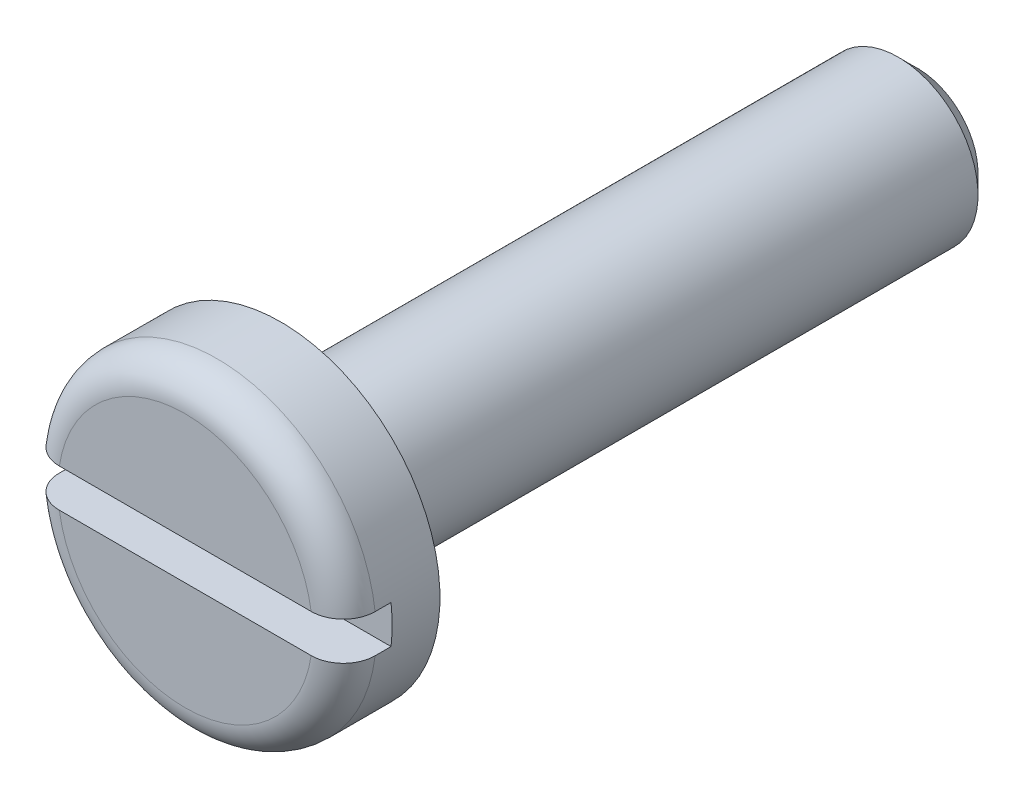
ISO-10303-21;
HEADER;
FILE_DESCRIPTION(('STEP AP214'),'2;1');
FILE_NAME('part.step','',(''),(''),'','','');
FILE_SCHEMA(('AUTOMOTIVE_DESIGN { 1 0 10303 214 1 1 1 1 }'));
ENDSEC;
DATA;
#1=APPLICATION_CONTEXT('core data for automotive mechanical design processes');
#2=APPLICATION_PROTOCOL_DEFINITION('international standard','automotive_design',2000,#1);
#3=PRODUCT_CONTEXT('',#1,'mechanical');
#4=PRODUCT('Part','Part','',(#3));
#5=PRODUCT_RELATED_PRODUCT_CATEGORY('part','',(#4));
#6=PRODUCT_DEFINITION_FORMATION('','',#4);
#7=PRODUCT_DEFINITION_CONTEXT('part definition',#1,'design');
#8=PRODUCT_DEFINITION('design','',#6,#7);
#9=PRODUCT_DEFINITION_SHAPE('','',#8);
#10=(LENGTH_UNIT() NAMED_UNIT(*) SI_UNIT(.MILLI.,.METRE.));
#11=(NAMED_UNIT(*) PLANE_ANGLE_UNIT() SI_UNIT($,.RADIAN.));
#12=(NAMED_UNIT(*) SI_UNIT($,.STERADIAN.) SOLID_ANGLE_UNIT());
#13=UNCERTAINTY_MEASURE_WITH_UNIT(LENGTH_MEASURE(1.E-05),#10,'distance_accuracy_value','');
#14=(GEOMETRIC_REPRESENTATION_CONTEXT(3) GLOBAL_UNCERTAINTY_ASSIGNED_CONTEXT((#13)) GLOBAL_UNIT_ASSIGNED_CONTEXT((#10,
#11,#12)) REPRESENTATION_CONTEXT('',''));
#15=CARTESIAN_POINT('',(0.,0.,0.));
#16=DIRECTION('',(0.,0.,1.));
#17=DIRECTION('',(1.,0.,0.));
#18=AXIS2_PLACEMENT_3D('',#15,#16,#17);
#19=CARTESIAN_POINT('',(0.,0.,0.));
#20=DIRECTION('',(0.,0.,0.999999999999908));
#21=DIRECTION('',(1.00000000000001,0.,0.));
#22=AXIS2_PLACEMENT_3D('',#19,#20,#21);
#23=PLANE('',#22);
#24=DIRECTION('',(1.00000000000001,0.,0.));
#25=VECTOR('',#24,1.);
#26=CARTESIAN_POINT('',(-5.00000000000057,-0.600000000000649,5.55111512312578E-13));
#27=LINE('',#26,#25);
#28=CARTESIAN_POINT('',(-3.95474398665757,-0.600000000000329,2.83106871279415E-12));
#29=VERTEX_POINT('',#28);
#30=CARTESIAN_POINT('',(3.95474398665656,-0.600000000000295,2.38697950294409E-12));
#31=VERTEX_POINT('',#30);
#32=EDGE_CURVE('E138',#29,#31,#27,.T.);
#33=ORIENTED_EDGE('',*,*,#32,.F.);
#34=CARTESIAN_POINT('',(0.,0.,0.));
#35=DIRECTION('',(0.,0.,0.999999999999908));
#36=DIRECTION('',(1.00000000000001,0.,0.));
#37=AXIS2_PLACEMENT_3D('',#34,#35,#36);
#38=CIRCLE('',#37,4.);
#39=EDGE_CURVE('E154',#29,#31,#38,.T.);
#40=ORIENTED_EDGE('',*,*,#39,.T.);
#41=EDGE_LOOP('',(#33,#40));
#42=FACE_BOUND('',#41,.T.);
#43=ADVANCED_FACE('F48',(#42),#23,.T.);
#44=DIRECTION('',(1.00000000000001,0.,0.));
#45=VECTOR('',#44,1.);
#46=CARTESIAN_POINT('',(-5.00000000000068,0.59999999999992,9.71445146547012E-13));
#47=LINE('',#46,#45);
#48=CARTESIAN_POINT('',(-3.95474398665734,0.599999999998886,6.66133814775094E-13));
#49=VERTEX_POINT('',#48);
#50=CARTESIAN_POINT('',(3.95474398665666,0.599999999999129,9.43689570931383E-13));
#51=VERTEX_POINT('',#50);
#52=EDGE_CURVE('E120',#49,#51,#47,.T.);
#53=ORIENTED_EDGE('',*,*,#52,.T.);
#54=CARTESIAN_POINT('',(0.,0.,0.));
#55=DIRECTION('',(0.,0.,0.999999999999908));
#56=DIRECTION('',(1.00000000000001,0.,0.));
#57=AXIS2_PLACEMENT_3D('',#54,#55,#56);
#58=CIRCLE('',#57,4.);
#59=EDGE_CURVE('E69',#51,#49,#58,.T.);
#60=ORIENTED_EDGE('',*,*,#59,.T.);
#61=EDGE_LOOP('',(#53,#60));
#62=FACE_BOUND('',#61,.T.);
#63=ADVANCED_FACE('F202',(#62),#23,.T.);
#64=CARTESIAN_POINT('',(-6.24500451351651E-13,-2.91433543964104E-13,-23.));
#65=DIRECTION('',(0.,0.,-0.999999999999908));
#66=DIRECTION('',(-1.00000000000001,0.,0.));
#67=AXIS2_PLACEMENT_3D('',#64,#65,#66);
#68=CYLINDRICAL_SURFACE('',#67,5.);
#69=DIRECTION('',(0.,0.,-0.999999999999908));
#70=VECTOR('',#69,1.);
#71=CARTESIAN_POINT('',(4.96386945839604,-0.600000000000475,-22.9999999999972));
#72=LINE('',#71,#70);
#73=CARTESIAN_POINT('',(4.96386945839637,-0.600000000001051,-0.999999999998086));
#74=VERTEX_POINT('',#73);
#75=CARTESIAN_POINT('',(4.96386945839632,-0.600000000001606,-1.49999999999809));
#76=VERTEX_POINT('',#75);
#77=EDGE_CURVE('E111',#74,#76,#72,.T.);
#78=ORIENTED_EDGE('',*,*,#77,.F.);
#79=CARTESIAN_POINT('',(-1.94289029309402E-13,-4.37150315946155E-13,-1.));
#80=DIRECTION('',(0.,0.,0.999999999999908));
#81=DIRECTION('',(1.00000000000001,0.,0.));
#82=AXIS2_PLACEMENT_3D('',#79,#80,#81);
#83=CIRCLE('',#82,5.);
#84=CARTESIAN_POINT('',(-4.96386945839604,-0.599999999999858,-0.999999999999529));
#85=VERTEX_POINT('',#84);
#86=EDGE_CURVE('E155',#74,#85,#83,.F.);
#87=ORIENTED_EDGE('',*,*,#86,.T.);
#88=DIRECTION('',(0.,0.,-0.999999999999908));
#89=VECTOR('',#88,1.);
#90=CARTESIAN_POINT('',(-4.96386945839698,-0.600000000000316,-22.9999999999979));
#91=LINE('',#90,#89);
#92=CARTESIAN_POINT('',(-4.96386945839622,-0.600000000000128,-1.49999999999953));
#93=VERTEX_POINT('',#92);
#94=EDGE_CURVE('E128',#93,#85,#91,.F.);
#95=ORIENTED_EDGE('',*,*,#94,.F.);
#96=CARTESIAN_POINT('',(-4.57966997657877E-13,-9.71445146547012E-13,-1.5));
#97=DIRECTION('',(0.,0.,-0.999999999999908));
#98=DIRECTION('',(-1.00000000000001,0.,0.));
#99=AXIS2_PLACEMENT_3D('',#96,#97,#98);
#100=CIRCLE('',#99,5.);
#101=CARTESIAN_POINT('',(-4.96386945839664,0.599999999998532,-1.49999999999817));
#102=VERTEX_POINT('',#101);
#103=EDGE_CURVE('E112',#102,#93,#100,.F.);
#104=ORIENTED_EDGE('',*,*,#103,.F.);
#105=DIRECTION('',(0.,0.,-0.999999999999908));
#106=VECTOR('',#105,1.);
#107=CARTESIAN_POINT('',(-4.96386945839679,0.599999999999233,-22.9999999999979));
#108=LINE('',#107,#106);
#109=CARTESIAN_POINT('',(-4.96386945839615,0.599999999999185,-0.999999999998613));
#110=VERTEX_POINT('',#109);
#111=EDGE_CURVE('E100',#110,#102,#108,.T.);
#112=ORIENTED_EDGE('',*,*,#111,.F.);
#113=CARTESIAN_POINT('',(-1.94289029309402E-13,-4.37150315946155E-13,-1.));
#114=DIRECTION('',(0.,0.,0.999999999999908));
#115=DIRECTION('',(1.00000000000001,0.,0.));
#116=AXIS2_PLACEMENT_3D('',#113,#114,#115);
#117=CIRCLE('',#116,5.);
#118=CARTESIAN_POINT('',(4.96386945839669,0.599999999999809,-0.99999999999692));
#119=VERTEX_POINT('',#118);
#120=EDGE_CURVE('E158',#110,#119,#117,.F.);
#121=ORIENTED_EDGE('',*,*,#120,.T.);
#122=DIRECTION('',(0.,0.,-0.999999999999908));
#123=VECTOR('',#122,1.);
#124=CARTESIAN_POINT('',(4.9638694583955,0.599999999999559,-22.9999999999968));
#125=LINE('',#124,#123);
#126=CARTESIAN_POINT('',(4.96386945839604,0.59999999999906,-1.49999999999692));
#127=VERTEX_POINT('',#126);
#128=EDGE_CURVE('E129',#127,#119,#125,.F.);
#129=ORIENTED_EDGE('',*,*,#128,.F.);
#130=EDGE_CURVE('E119',#76,#127,#100,.F.);
#131=ORIENTED_EDGE('',*,*,#130,.F.);
#132=EDGE_LOOP('',(#78,#87,#95,#104,#112,#121,#129,#131));
#133=FACE_BOUND('',#132,.T.);
#134=CARTESIAN_POINT('',(-6.10622663543836E-13,-9.43689570931383E-13,-3.));
#135=DIRECTION('',(0.,0.,-0.999999999999908));
#136=DIRECTION('',(-1.00000000000001,0.,0.));
#137=AXIS2_PLACEMENT_3D('',#134,#135,#136);
#138=CIRCLE('',#137,5.);
#139=CARTESIAN_POINT('',(-5.00000000000066,-9.55346912689947E-13,-3.));
#140=VERTEX_POINT('',#139);
#141=EDGE_CURVE('E133',#140,#140,#138,.T.);
#142=ORIENTED_EDGE('',*,*,#141,.F.);
#143=EDGE_LOOP('',(#142));
#144=FACE_BOUND('',#143,.T.);
#145=ADVANCED_FACE('F124',(#133,#144),#68,.T.);
#146=CARTESIAN_POINT('',(-5.00000000000037,-6.59194920871187E-13,-2.99999999999861));
#147=DIRECTION('',(0.,0.,-0.999999999999908));
#148=DIRECTION('',(-1.00000000000001,0.,0.));
#149=AXIS2_PLACEMENT_3D('',#146,#147,#148);
#150=PLANE('',#149);
#151=CARTESIAN_POINT('',(-6.10622663543836E-13,-9.43689570931383E-13,-3.));
#152=DIRECTION('',(0.,0.,-0.999999999999908));
#153=DIRECTION('',(-1.00000000000001,0.,0.));
#154=AXIS2_PLACEMENT_3D('',#151,#152,#153);
#155=CIRCLE('',#154,2.9);
#156=CARTESIAN_POINT('',(-2.90000000000064,-9.5045082915135E-13,-3.));
#157=VERTEX_POINT('',#156);
#158=EDGE_CURVE('E13',#157,#157,#155,.F.);
#159=ORIENTED_EDGE('',*,*,#158,.T.);
#160=EDGE_LOOP('',(#159));
#161=FACE_BOUND('',#160,.T.);
#162=ORIENTED_EDGE('',*,*,#141,.T.);
#163=EDGE_LOOP('',(#162));
#164=FACE_BOUND('',#163,.T.);
#165=ADVANCED_FACE('F233',(#161,#164),#150,.T.);
#166=CARTESIAN_POINT('',(-6.24500451351651E-13,-2.91433543964104E-13,-23.));
#167=DIRECTION('',(0.,0.,-0.999999999999908));
#168=DIRECTION('',(-1.00000000000001,0.,0.));
#169=AXIS2_PLACEMENT_3D('',#166,#167,#168);
#170=CYLINDRICAL_SURFACE('',#169,2.5);
#171=CARTESIAN_POINT('',(-7.63278329429795E-13,0.,-3.39999999999999));
#172=DIRECTION('',(0.,0.,-0.999999999999908));
#173=DIRECTION('',(-1.00000000000001,0.,0.));
#174=AXIS2_PLACEMENT_3D('',#171,#172,#173);
#175=CIRCLE('',#174,2.5);
#176=CARTESIAN_POINT('',(-2.50000000000079,0.,-3.39999999999999));
#177=VERTEX_POINT('',#176);
#178=EDGE_CURVE('E56',#177,#177,#175,.T.);
#179=ORIENTED_EDGE('',*,*,#178,.T.);
#180=EDGE_LOOP('',(#179));
#181=FACE_BOUND('',#180,.T.);
#182=CARTESIAN_POINT('',(0.,2.70616862252382E-13,-22.4));
#183=DIRECTION('',(0.,0.,-0.999999999999908));
#184=DIRECTION('',(-1.00000000000001,0.,0.));
#185=AXIS2_PLACEMENT_3D('',#182,#183,#184);
#186=CIRCLE('',#185,2.5);
#187=CARTESIAN_POINT('',(-2.50000000000001,2.647881913731E-13,-22.4));
#188=VERTEX_POINT('',#187);
#189=EDGE_CURVE('E216',#188,#188,#186,.F.);
#190=ORIENTED_EDGE('',*,*,#189,.T.);
#191=EDGE_LOOP('',(#190));
#192=FACE_BOUND('',#191,.T.);
#193=ADVANCED_FACE('F228',(#181,#192),#170,.T.);
#194=CARTESIAN_POINT('',(-2.50000000000029,-7.63278329429795E-13,-22.9999999999981));
#195=DIRECTION('',(0.,0.,-0.999999999999908));
#196=DIRECTION('',(-1.00000000000001,0.,0.));
#197=AXIS2_PLACEMENT_3D('',#194,#195,#196);
#198=PLANE('',#197);
#199=CARTESIAN_POINT('',(-6.24500451351651E-13,-2.91433543964104E-13,-23.));
#200=DIRECTION('',(0.,0.,-0.999999999999908));
#201=DIRECTION('',(-1.00000000000001,0.,0.));
#202=AXIS2_PLACEMENT_3D('',#199,#200,#201);
#203=CIRCLE('',#202,1.9);
#204=CARTESIAN_POINT('',(-1.90000000000064,-2.95863333832358E-13,-23.));
#205=VERTEX_POINT('',#204);
#206=EDGE_CURVE('E219',#205,#205,#203,.T.);
#207=ORIENTED_EDGE('',*,*,#206,.T.);
#208=EDGE_LOOP('',(#207));
#209=FACE_BOUND('',#208,.T.);
#210=ADVANCED_FACE('F232',(#209),#198,.T.);
#211=CARTESIAN_POINT('',(-5.00000000000046,0.599999999999164,-1.49999999999825));
#212=DIRECTION('',(0.,0.,-0.999999999999908));
#213=DIRECTION('',(-1.00000000000001,0.,0.));
#214=AXIS2_PLACEMENT_3D('',#211,#212,#213);
#215=PLANE('',#214);
#216=DIRECTION('',(1.00000000000001,0.,0.));
#217=VECTOR('',#216,1.);
#218=CARTESIAN_POINT('',(-5.00000000000043,-0.600000000001315,-1.49999999999945));
#219=LINE('',#218,#217);
#220=EDGE_CURVE('E135',#93,#76,#219,.T.);
#221=ORIENTED_EDGE('',*,*,#220,.T.);
#222=ORIENTED_EDGE('',*,*,#130,.T.);
#223=DIRECTION('',(1.00000000000001,0.,0.));
#224=VECTOR('',#223,1.);
#225=CARTESIAN_POINT('',(-5.00000000000046,0.599999999999164,-1.49999999999825));
#226=LINE('',#225,#224);
#227=EDGE_CURVE('E103',#102,#127,#226,.T.);
#228=ORIENTED_EDGE('',*,*,#227,.F.);
#229=ORIENTED_EDGE('',*,*,#103,.T.);
#230=EDGE_LOOP('',(#221,#222,#228,#229));
#231=FACE_BOUND('',#230,.T.);
#232=ADVANCED_FACE('F116',(#231),#215,.F.);
#233=CARTESIAN_POINT('',(-5.00000000000057,-0.600000000000649,5.55111512312578E-13));
#234=DIRECTION('',(0.,-1.00000000000001,0.));
#235=DIRECTION('',(0.,0.,-0.999999999999908));
#236=AXIS2_PLACEMENT_3D('',#233,#234,#235);
#237=PLANE('',#236);
#238=ORIENTED_EDGE('',*,*,#94,.T.);
#239=CARTESIAN_POINT('',(-4.96386945839604,-0.599999999999858,-0.999999999999529));
#240=CARTESIAN_POINT('',(-4.96386935741229,-0.60000000000032,-0.972022108572007));
#241=CARTESIAN_POINT('',(-4.96268601853647,-0.60000000000055,-0.944057662533719));
#242=CARTESIAN_POINT('',(-4.95796578525232,-0.600000000000747,-0.888329823618643));
#243=CARTESIAN_POINT('',(-4.95442903149559,-0.600000000000714,-0.860566418826879));
#244=CARTESIAN_POINT('',(-4.94032500640627,-0.600000000000519,-0.777934683491496));
#245=CARTESIAN_POINT('',(-4.92626386141264,-0.600000000000264,-0.723621384662121));
#246=CARTESIAN_POINT('',(-4.88922812444244,-0.600000000000284,-0.618130409129646));
#247=CARTESIAN_POINT('',(-4.86624977128603,-0.600000000000561,-0.566954066121022));
#248=CARTESIAN_POINT('',(-4.81205190848971,-0.600000000000737,-0.469170873409144));
#249=CARTESIAN_POINT('',(-4.78083344587253,-0.600000000000636,-0.422563444191722));
#250=CARTESIAN_POINT('',(-4.71096223391588,-0.600000000000661,-0.335094358274084));
#251=CARTESIAN_POINT('',(-4.67228925696044,-0.600000000000788,-0.294248870964618));
#252=CARTESIAN_POINT('',(-4.58866914131414,-0.60000000000051,-0.219568897939788));
#253=CARTESIAN_POINT('',(-4.54372080088419,-0.600000000000105,-0.18573575818738));
#254=CARTESIAN_POINT('',(-4.44849971003693,-0.600000000000208,-0.125787837988635));
#255=CARTESIAN_POINT('',(-4.39819134553052,-0.600000000000723,-0.099729697512014));
#256=CARTESIAN_POINT('',(-4.29394731423892,-0.600000000000575,-0.0563548939682483));
#257=CARTESIAN_POINT('',(-4.24001317793829,-0.599999999999914,-0.0390345684893863));
#258=CARTESIAN_POINT('',(-4.14729474887981,-0.60000000000003,-0.0175553504894735));
#259=CARTESIAN_POINT('',(-4.10905308214748,-0.600000000000422,-0.0109737030128535));
#260=CARTESIAN_POINT('',(-4.03212682101485,-0.600000000000876,-0.00219639868649645));
#261=CARTESIAN_POINT('',(-3.99344296364207,-0.600000000000938,5.71718467295407E-06));
#262=CARTESIAN_POINT('',(-3.95474398665757,-0.600000000000329,2.83106871279415E-12));
#263=B_SPLINE_CURVE_WITH_KNOTS('',3,(#239,#240,#241,#242,#243,#244,#245,#246,#247,#248,#249,
#250,#251,#252,#253,#254,#255,#256,#257,#258,#259,#260,#261,#262),.UNSPECIFIED.,.F.,.F.,(4,2,2,
2,2,2,2,2,2,2,2,4),(0.,0.083881973901169,0.167758935054979,0.335206476610084,0.502724722586501,
0.670221693233156,0.838179728370713,1.00616997188981,1.17535569340953,1.34447044253459,
1.46064633675752,1.57665076499491),.UNSPECIFIED.);
#264=EDGE_CURVE('E148',#85,#29,#263,.T.);
#265=ORIENTED_EDGE('',*,*,#264,.T.);
#266=ORIENTED_EDGE('',*,*,#32,.T.);
#267=CARTESIAN_POINT('',(3.95474398665656,-0.600000000000295,2.38697950294409E-12));
#268=CARTESIAN_POINT('',(3.98334879202399,-0.600000000000409,-3.20576999300899E-07));
#269=CARTESIAN_POINT('',(4.01194022474002,-0.60000000000056,-0.00120049597698742));
#270=CARTESIAN_POINT('',(4.06892163058331,-0.600000000000743,-0.00599291819944513));
#271=CARTESIAN_POINT('',(4.09731160494167,-0.600000000000775,-0.00958515039134394));
#272=CARTESIAN_POINT('',(4.18184520817053,-0.600000000000405,-0.02392618219437));
#273=CARTESIAN_POINT('',(4.23742704092372,-0.599999999999536,-0.0382393650387615));
#274=CARTESIAN_POINT('',(4.34540231829703,-0.599999999999541,-0.0760171148264929));
#275=CARTESIAN_POINT('',(4.39779355760598,-0.600000000000417,-0.0994879302823703));
#276=CARTESIAN_POINT('',(4.49784818989319,-0.600000000000886,-0.154945232765757));
#277=CARTESIAN_POINT('',(4.54551300871755,-0.60000000000048,-0.186929140807174));
#278=CARTESIAN_POINT('',(4.63442494135908,-0.600000000000484,-0.258290666535006));
#279=CARTESIAN_POINT('',(4.67571215294189,-0.600000000000888,-0.297618339257019));
#280=CARTESIAN_POINT('',(4.75103738926572,-0.600000000000416,-0.3827116088463));
#281=CARTESIAN_POINT('',(4.78507403927559,-0.599999999999539,-0.428478423870268));
#282=CARTESIAN_POINT('',(4.84461756735682,-0.599999999999635,-0.524718394917832));
#283=CARTESIAN_POINT('',(4.87019400763589,-0.600000000000592,-0.575148572397457));
#284=CARTESIAN_POINT('',(4.91244181662869,-0.600000000000712,-0.679593456087428));
#285=CARTESIAN_POINT('',(4.92911940303028,-0.599999999999875,-0.733605629789103));
#286=CARTESIAN_POINT('',(4.94867124952275,-0.599999999999948,-0.82332549445804));
#287=CARTESIAN_POINT('',(4.95436739083217,-0.600000000000328,-0.858443348703506));
#288=CARTESIAN_POINT('',(4.96196566163608,-0.600000000000976,-0.929035632823881));
#289=CARTESIAN_POINT('',(4.96387326578748,-0.600000000001244,-0.964509473610284));
#290=CARTESIAN_POINT('',(4.96386945839637,-0.600000000001051,-0.999999999998086));
#291=B_SPLINE_CURVE_WITH_KNOTS('',3,(#267,#268,#269,#270,#271,#272,#273,#274,#275,#276,#277,
#278,#279,#280,#281,#282,#283,#284,#285,#286,#287,#288,#289,#290),.UNSPECIFIED.,.F.,.F.,(4,2,2,
2,2,2,2,2,2,2,2,4),(0.,0.0857624809866163,0.171524437427776,0.342827604543508,0.514247861655272,
0.685616247103166,0.855859011795874,1.0261340264224,1.19497201655058,1.363691883472,
1.47023374034644,1.57662152568152),.UNSPECIFIED.);
#292=EDGE_CURVE('E147',#31,#74,#291,.T.);
#293=ORIENTED_EDGE('',*,*,#292,.T.);
#294=ORIENTED_EDGE('',*,*,#77,.T.);
#295=ORIENTED_EDGE('',*,*,#220,.F.);
#296=EDGE_LOOP('',(#238,#265,#266,#293,#294,#295));
#297=FACE_BOUND('',#296,.T.);
#298=ADVANCED_FACE('F146',(#297),#237,.F.);
#299=CARTESIAN_POINT('',(-5.00000000000068,0.59999999999992,9.71445146547012E-13));
#300=DIRECTION('',(0.,1.00000000000001,0.));
#301=DIRECTION('',(0.,0.,0.999999999999908));
#302=AXIS2_PLACEMENT_3D('',#299,#300,#301);
#303=PLANE('',#302);
#304=ORIENTED_EDGE('',*,*,#128,.T.);
#305=CARTESIAN_POINT('',(4.96386945839669,0.599999999999809,-0.99999999999692));
#306=CARTESIAN_POINT('',(4.96386935741234,0.599999999999864,-0.972022108569535));
#307=CARTESIAN_POINT('',(4.96268601853611,0.599999999999899,-0.944057662531437));
#308=CARTESIAN_POINT('',(4.95796578525151,0.599999999999934,-0.888329823616609));
#309=CARTESIAN_POINT('',(4.95442903149473,0.599999999999934,-0.860566418824904));
#310=CARTESIAN_POINT('',(4.94032500640577,0.599999999999882,-0.777934683489503));
#311=CARTESIAN_POINT('',(4.9262638614131,0.59999999999978,-0.723621384659865));
#312=CARTESIAN_POINT('',(4.88922812444268,0.59999999999981,-0.618130409127778));
#313=CARTESIAN_POINT('',(4.8662497712851,0.599999999999941,-0.566954066119803));
#314=CARTESIAN_POINT('',(4.81205190848861,0.599999999999892,-0.469170873408152));
#315=CARTESIAN_POINT('',(4.78083344587243,0.599999999999712,-0.422563444190303));
#316=CARTESIAN_POINT('',(4.71096223391615,0.599999999999781,-0.335094358272798));
#317=CARTESIAN_POINT('',(4.67228925696006,0.600000000000031,-0.294248870963909));
#318=CARTESIAN_POINT('',(4.58866914131297,0.599999999999803,-0.219568897939841));
#319=CARTESIAN_POINT('',(4.54372080088289,0.599999999999324,-0.185735758187628));
#320=CARTESIAN_POINT('',(4.4484997100356,0.599999999999364,-0.125787837988838));
#321=CARTESIAN_POINT('',(4.39819134552929,0.599999999999889,-0.0997296975119694));
#322=CARTESIAN_POINT('',(4.29394731423794,0.599999999999945,-0.0563548939677119));
#323=CARTESIAN_POINT('',(4.24001317793745,0.599999999999476,-0.0390345684885866));
#324=CARTESIAN_POINT('',(4.14729474887911,0.599999999999558,-0.0175553504888095));
#325=CARTESIAN_POINT('',(4.10905308214681,0.599999999999836,-0.0109737030124062));
#326=CARTESIAN_POINT('',(4.03212682101409,0.599999999999998,-0.00219639868687496));
#327=CARTESIAN_POINT('',(3.99344296364121,0.599999999999882,5.71718367135213E-06));
#328=CARTESIAN_POINT('',(3.95474398665666,0.599999999999129,9.43689570931383E-13));
#329=B_SPLINE_CURVE_WITH_KNOTS('',3,(#305,#306,#307,#308,#309,#310,#311,#312,#313,#314,#315,
#316,#317,#318,#319,#320,#321,#322,#323,#324,#325,#326,#327,#328),.UNSPECIFIED.,.F.,.F.,(4,2,2,
2,2,2,2,2,2,2,2,4),(0.,0.0838819739007118,0.167758935054422,0.335206476609354,0.502724722585475,
0.670221693231623,0.838179728369042,1.00616997188829,1.17535569340812,1.34447044253292,
1.46064633675563,1.57665076499317),.UNSPECIFIED.);
#330=EDGE_CURVE('E63',#119,#51,#329,.T.);
#331=ORIENTED_EDGE('',*,*,#330,.T.);
#332=ORIENTED_EDGE('',*,*,#52,.F.);
#333=CARTESIAN_POINT('',(-3.95474398665734,0.599999999998886,6.66133814775094E-13));
#334=CARTESIAN_POINT('',(-3.98334879202484,0.599999999999531,-3.20577558448696E-07));
#335=CARTESIAN_POINT('',(-4.01194022474088,0.599999999999811,-0.00120049597714358));
#336=CARTESIAN_POINT('',(-4.06892163058419,0.600000000000028,-0.00599291819937223));
#337=CARTESIAN_POINT('',(-4.09731160494257,0.599999999999964,-0.00958515039144803));
#338=CARTESIAN_POINT('',(-4.18184520817147,0.59999999999983,-0.0239261821944377));
#339=CARTESIAN_POINT('',(-4.23742704092482,0.599999999999818,-0.0382393650380502));
#340=CARTESIAN_POINT('',(-4.34540231829802,0.600000000000009,-0.0760171148257388));
#341=CARTESIAN_POINT('',(-4.39779355760671,0.600000000000212,-0.0994879302823695));
#342=CARTESIAN_POINT('',(-4.49784818989392,0.599999999999627,-0.154945232766159));
#343=CARTESIAN_POINT('',(-4.54551300871855,0.59999999999884,-0.186929140807229));
#344=CARTESIAN_POINT('',(-4.63442494136004,0.599999999998877,-0.258290666534844));
#345=CARTESIAN_POINT('',(-4.67571215294259,0.599999999999692,-0.297618339256947));
#346=CARTESIAN_POINT('',(-4.7510373892657,0.600000000000148,-0.382711608846302));
#347=CARTESIAN_POINT('',(-4.78507403927513,0.599999999999789,-0.428478423870252));
#348=CARTESIAN_POINT('',(-4.84461756735666,0.599999999999677,-0.52471839491767));
#349=CARTESIAN_POINT('',(-4.87019400763642,0.59999999999992,-0.575148572397204));
#350=CARTESIAN_POINT('',(-4.91244181662885,0.59999999999992,-0.679593456087574));
#351=CARTESIAN_POINT('',(-4.92911940302941,0.599999999999678,-0.73360562978974));
#352=CARTESIAN_POINT('',(-4.94867124952221,0.599999999999767,-0.823325494458862));
#353=CARTESIAN_POINT('',(-4.95436739083227,0.599999999999921,-0.858443348704197));
#354=CARTESIAN_POINT('',(-4.96196566163686,0.599999999999919,-0.929035632824367));
#355=CARTESIAN_POINT('',(-4.9638732657883,0.599999999999764,-0.964509473610696));
#356=CARTESIAN_POINT('',(-4.96386945839615,0.599999999999185,-0.999999999998613));
#357=B_SPLINE_CURVE_WITH_KNOTS('',3,(#333,#334,#335,#336,#337,#338,#339,#340,#341,#342,#343,
#344,#345,#346,#347,#348,#349,#350,#351,#352,#353,#354,#355,#356),.UNSPECIFIED.,.F.,.F.,(4,2,2,
2,2,2,2,2,2,2,2,4),(0.,0.0857624809866186,0.17152443742789,0.342827604543453,0.51424786165535,
0.68561624710345,0.855859011795585,1.02613402642149,1.19497201655018,1.36369188347215,
1.47023374034654,1.57662152568151),.UNSPECIFIED.);
#358=EDGE_CURVE('E106',#49,#110,#357,.T.);
#359=ORIENTED_EDGE('',*,*,#358,.T.);
#360=ORIENTED_EDGE('',*,*,#111,.T.);
#361=ORIENTED_EDGE('',*,*,#227,.T.);
#362=EDGE_LOOP('',(#304,#331,#332,#359,#360,#361));
#363=FACE_BOUND('',#362,.T.);
#364=ADVANCED_FACE('F102',(#363),#303,.F.);
#365=CARTESIAN_POINT('',(-6.24500451351651E-13,-2.91433543964104E-13,-23.));
#366=DIRECTION('',(0.,0.,0.999999999999908));
#367=DIRECTION('',(1.00000000000001,0.,0.));
#368=AXIS2_PLACEMENT_3D('',#365,#366,#367);
#369=CONICAL_SURFACE('',#368,1.9,0.785398163397447);
#370=ORIENTED_EDGE('',*,*,#189,.F.);
#371=EDGE_LOOP('',(#370));
#372=FACE_BOUND('',#371,.T.);
#373=ORIENTED_EDGE('',*,*,#206,.F.);
#374=EDGE_LOOP('',(#373));
#375=FACE_BOUND('',#374,.T.);
#376=ADVANCED_FACE('F179',(#372,#375),#369,.T.);
#377=CARTESIAN_POINT('',(-1.94289029309402E-13,-4.37150315946155E-13,-1.));
#378=DIRECTION('',(0.,0.,0.999999999999908));
#379=DIRECTION('',(1.00000000000001,0.,0.));
#380=AXIS2_PLACEMENT_3D('',#377,#378,#379);
#381=TOROIDAL_SURFACE('',#380,4.,1.);
#382=ORIENTED_EDGE('',*,*,#292,.F.);
#383=ORIENTED_EDGE('',*,*,#39,.F.);
#384=ORIENTED_EDGE('',*,*,#264,.F.);
#385=ORIENTED_EDGE('',*,*,#86,.F.);
#386=EDGE_LOOP('',(#382,#383,#384,#385));
#387=FACE_BOUND('',#386,.T.);
#388=ADVANCED_FACE('F153',(#387),#381,.T.);
#389=CARTESIAN_POINT('',(-1.94289029309402E-13,-4.37150315946155E-13,-1.));
#390=DIRECTION('',(0.,0.,0.999999999999908));
#391=DIRECTION('',(1.00000000000001,0.,0.));
#392=AXIS2_PLACEMENT_3D('',#389,#390,#391);
#393=TOROIDAL_SURFACE('',#392,4.,1.);
#394=ORIENTED_EDGE('',*,*,#358,.F.);
#395=ORIENTED_EDGE('',*,*,#59,.F.);
#396=ORIENTED_EDGE('',*,*,#330,.F.);
#397=ORIENTED_EDGE('',*,*,#120,.F.);
#398=EDGE_LOOP('',(#394,#395,#396,#397));
#399=FACE_BOUND('',#398,.T.);
#400=ADVANCED_FACE('F191',(#399),#393,.T.);
#401=CARTESIAN_POINT('',(-7.63278329429795E-13,0.,-3.39999999999999));
#402=DIRECTION('',(0.,0.,-0.999999999999908));
#403=DIRECTION('',(-1.00000000000001,0.,0.));
#404=AXIS2_PLACEMENT_3D('',#401,#402,#403);
#405=TOROIDAL_SURFACE('',#404,2.9,0.4);
#406=ORIENTED_EDGE('',*,*,#158,.F.);
#407=EDGE_LOOP('',(#406));
#408=FACE_BOUND('',#407,.T.);
#409=ORIENTED_EDGE('',*,*,#178,.F.);
#410=EDGE_LOOP('',(#409));
#411=FACE_BOUND('',#410,.T.);
#412=ADVANCED_FACE('F50',(#408,#411),#405,.F.);
#413=CLOSED_SHELL('',(#43,#63,#145,#165,#193,#210,#232,#298,#364,#376,#388,#400,#412));
#414=MANIFOLD_SOLID_BREP('B2',#413);
#415=ADVANCED_BREP_SHAPE_REPRESENTATION('',(#18,#414),#14);
#416=SHAPE_DEFINITION_REPRESENTATION(#9,#415);
ENDSEC;
END-ISO-10303-21;
